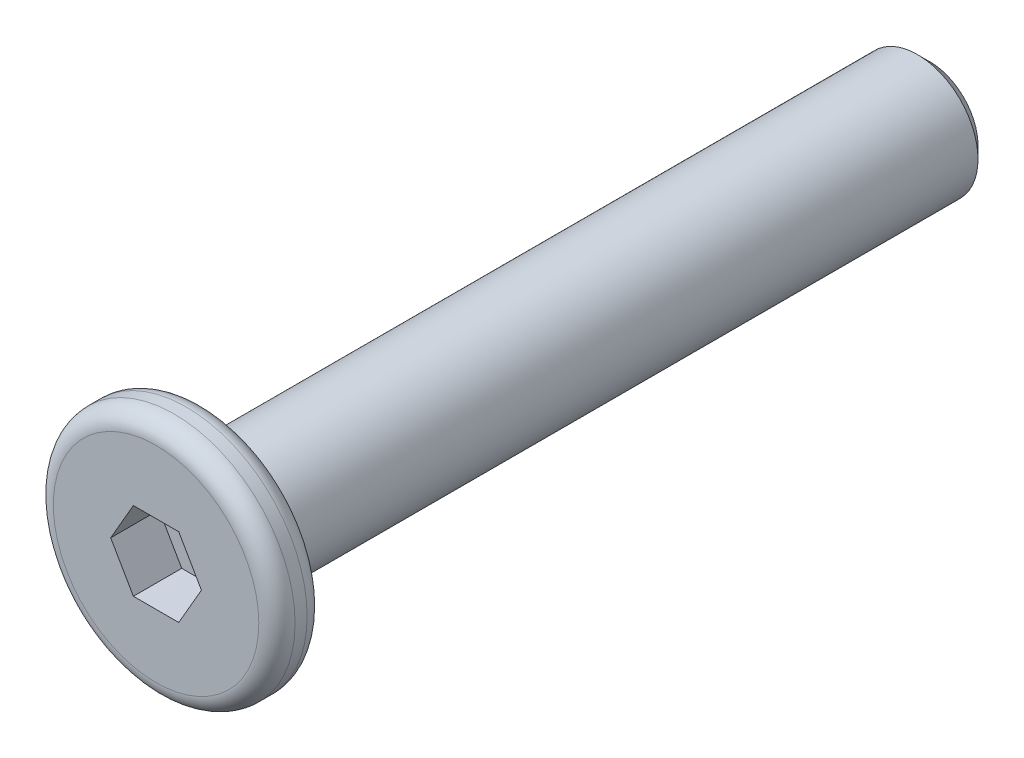
ISO-10303-21;
HEADER;
FILE_DESCRIPTION(('STEP AP214'),'2;1');
FILE_NAME('part.step','',(''),(''),'','','');
FILE_SCHEMA(('AUTOMOTIVE_DESIGN { 1 0 10303 214 1 1 1 1 }'));
ENDSEC;
DATA;
#1=APPLICATION_CONTEXT('core data for automotive mechanical design processes');
#2=APPLICATION_PROTOCOL_DEFINITION('international standard','automotive_design',2000,#1);
#3=PRODUCT_CONTEXT('',#1,'mechanical');
#4=PRODUCT('Part','Part','',(#3));
#5=PRODUCT_RELATED_PRODUCT_CATEGORY('part','',(#4));
#6=PRODUCT_DEFINITION_FORMATION('','',#4);
#7=PRODUCT_DEFINITION_CONTEXT('part definition',#1,'design');
#8=PRODUCT_DEFINITION('design','',#6,#7);
#9=PRODUCT_DEFINITION_SHAPE('','',#8);
#10=(LENGTH_UNIT() NAMED_UNIT(*) SI_UNIT(.MILLI.,.METRE.));
#11=(NAMED_UNIT(*) PLANE_ANGLE_UNIT() SI_UNIT($,.RADIAN.));
#12=(NAMED_UNIT(*) SI_UNIT($,.STERADIAN.) SOLID_ANGLE_UNIT());
#13=UNCERTAINTY_MEASURE_WITH_UNIT(LENGTH_MEASURE(1.E-05),#10,'distance_accuracy_value','');
#14=(GEOMETRIC_REPRESENTATION_CONTEXT(3) GLOBAL_UNCERTAINTY_ASSIGNED_CONTEXT((#13)) GLOBAL_UNIT_ASSIGNED_CONTEXT((#10,
#11,#12)) REPRESENTATION_CONTEXT('',''));
#15=CARTESIAN_POINT('',(0.,0.,0.));
#16=DIRECTION('',(0.,0.,1.));
#17=DIRECTION('',(1.,0.,0.));
#18=AXIS2_PLACEMENT_3D('',#15,#16,#17);
#19=CARTESIAN_POINT('',(0.,0.,0.4));
#20=DIRECTION('',(0.,0.,-1.));
#21=DIRECTION('',(-1.,0.,0.));
#22=AXIS2_PLACEMENT_3D('',#19,#20,#21);
#23=CYLINDRICAL_SURFACE('',#22,2.);
#24=CARTESIAN_POINT('',(0.,0.,-0.1));
#25=DIRECTION('',(0.,0.,1.));
#26=DIRECTION('',(1.,0.,0.));
#27=AXIS2_PLACEMENT_3D('',#24,#25,#26);
#28=CIRCLE('',#27,2.);
#29=CARTESIAN_POINT('',(2.,0.,-0.1));
#30=VERTEX_POINT('',#29);
#31=EDGE_CURVE('E154',#30,#30,#28,.T.);
#32=ORIENTED_EDGE('',*,*,#31,.T.);
#33=EDGE_LOOP('',(#32));
#34=FACE_BOUND('',#33,.T.);
#35=CARTESIAN_POINT('',(0.,0.,0.1));
#36=DIRECTION('',(0.,0.,1.));
#37=DIRECTION('',(1.,0.,0.));
#38=AXIS2_PLACEMENT_3D('',#35,#36,#37);
#39=CIRCLE('',#38,2.);
#40=CARTESIAN_POINT('',(2.,0.,0.1));
#41=VERTEX_POINT('',#40);
#42=EDGE_CURVE('E151',#41,#41,#39,.F.);
#43=ORIENTED_EDGE('',*,*,#42,.T.);
#44=EDGE_LOOP('',(#43));
#45=FACE_BOUND('',#44,.T.);
#46=ADVANCED_FACE('F35',(#34,#45),#23,.T.);
#47=CARTESIAN_POINT('',(0.,0.,0.4));
#48=DIRECTION('',(0.,0.,1.));
#49=DIRECTION('',(1.,0.,0.));
#50=AXIS2_PLACEMENT_3D('',#47,#48,#49);
#51=PLANE('',#50);
#52=CARTESIAN_POINT('',(0.,0.,0.4));
#53=DIRECTION('',(0.,0.,1.));
#54=DIRECTION('',(1.,0.,0.));
#55=AXIS2_PLACEMENT_3D('',#52,#53,#54);
#56=CIRCLE('',#55,1.7);
#57=CARTESIAN_POINT('',(1.7,0.,0.4));
#58=VERTEX_POINT('',#57);
#59=EDGE_CURVE('E11',#58,#58,#56,.T.);
#60=ORIENTED_EDGE('',*,*,#59,.T.);
#61=EDGE_LOOP('',(#60));
#62=FACE_BOUND('',#61,.T.);
#63=DIRECTION('',(0.5,0.866025403784439,0.));
#64=VECTOR('',#63,1.);
#65=CARTESIAN_POINT('',(0.375277674973257,-0.65,0.4));
#66=LINE('',#65,#64);
#67=CARTESIAN_POINT('',(0.375277674973257,-0.65,0.4));
#68=VERTEX_POINT('',#67);
#69=CARTESIAN_POINT('',(0.750555349946514,0.,0.4));
#70=VERTEX_POINT('',#69);
#71=EDGE_CURVE('E50',#68,#70,#66,.T.);
#72=ORIENTED_EDGE('',*,*,#71,.F.);
#73=DIRECTION('',(1.,0.,0.));
#74=VECTOR('',#73,1.);
#75=CARTESIAN_POINT('',(-0.375277674973256,-0.65,0.4));
#76=LINE('',#75,#74);
#77=CARTESIAN_POINT('',(-0.375277674973256,-0.65,0.4));
#78=VERTEX_POINT('',#77);
#79=EDGE_CURVE('E133',#78,#68,#76,.T.);
#80=ORIENTED_EDGE('',*,*,#79,.F.);
#81=DIRECTION('',(0.5,-0.866025403784438,0.));
#82=VECTOR('',#81,1.);
#83=CARTESIAN_POINT('',(-0.750555349946513,0.,0.4));
#84=LINE('',#83,#82);
#85=CARTESIAN_POINT('',(-0.750555349946513,0.,0.4));
#86=VERTEX_POINT('',#85);
#87=EDGE_CURVE('E131',#86,#78,#84,.T.);
#88=ORIENTED_EDGE('',*,*,#87,.F.);
#89=DIRECTION('',(-0.5,-0.866025403784439,0.));
#90=VECTOR('',#89,1.);
#91=CARTESIAN_POINT('',(-0.375277674973257,0.65,0.4));
#92=LINE('',#91,#90);
#93=CARTESIAN_POINT('',(-0.375277674973257,0.65,0.4));
#94=VERTEX_POINT('',#93);
#95=EDGE_CURVE('E98',#94,#86,#92,.T.);
#96=ORIENTED_EDGE('',*,*,#95,.F.);
#97=DIRECTION('',(-1.,0.,0.));
#98=VECTOR('',#97,1.);
#99=CARTESIAN_POINT('',(0.375277674973257,0.65,0.4));
#100=LINE('',#99,#98);
#101=CARTESIAN_POINT('',(0.375277674973257,0.65,0.4));
#102=VERTEX_POINT('',#101);
#103=EDGE_CURVE('E127',#102,#94,#100,.T.);
#104=ORIENTED_EDGE('',*,*,#103,.F.);
#105=DIRECTION('',(-0.5,0.866025403784439,0.));
#106=VECTOR('',#105,1.);
#107=CARTESIAN_POINT('',(0.750555349946514,0.,0.4));
#108=LINE('',#107,#106);
#109=EDGE_CURVE('E124',#70,#102,#108,.T.);
#110=ORIENTED_EDGE('',*,*,#109,.F.);
#111=EDGE_LOOP('',(#72,#80,#88,#96,#104,#110));
#112=FACE_BOUND('',#111,.T.);
#113=ADVANCED_FACE('F169',(#62,#112),#51,.T.);
#114=CARTESIAN_POINT('',(0.,0.,-0.4));
#115=DIRECTION('',(0.,0.,1.));
#116=DIRECTION('',(1.,0.,0.));
#117=AXIS2_PLACEMENT_3D('',#114,#115,#116);
#118=PLANE('',#117);
#119=CARTESIAN_POINT('',(0.,0.,-0.4));
#120=DIRECTION('',(0.,0.,1.));
#121=DIRECTION('',(1.,0.,0.));
#122=AXIS2_PLACEMENT_3D('',#119,#120,#121);
#123=CIRCLE('',#122,1.7);
#124=CARTESIAN_POINT('',(1.7,0.,-0.4));
#125=VERTEX_POINT('',#124);
#126=EDGE_CURVE('E43',#125,#125,#123,.F.);
#127=ORIENTED_EDGE('',*,*,#126,.T.);
#128=EDGE_LOOP('',(#127));
#129=FACE_BOUND('',#128,.T.);
#130=CARTESIAN_POINT('',(0.,0.,-0.4));
#131=DIRECTION('',(0.,0.,-1.));
#132=DIRECTION('',(-1.,0.,0.));
#133=AXIS2_PLACEMENT_3D('',#130,#131,#132);
#134=CIRCLE('',#133,1.);
#135=CARTESIAN_POINT('',(-1.,0.,-0.4));
#136=VERTEX_POINT('',#135);
#137=EDGE_CURVE('E137',#136,#136,#134,.T.);
#138=ORIENTED_EDGE('',*,*,#137,.F.);
#139=EDGE_LOOP('',(#138));
#140=FACE_BOUND('',#139,.T.);
#141=ADVANCED_FACE('F159',(#129,#140),#118,.F.);
#142=CARTESIAN_POINT('',(0.,0.,-12.4));
#143=DIRECTION('',(0.,0.,1.));
#144=DIRECTION('',(1.,0.,0.));
#145=AXIS2_PLACEMENT_3D('',#142,#143,#144);
#146=CYLINDRICAL_SURFACE('',#145,1.);
#147=CARTESIAN_POINT('',(0.,0.,-12.2));
#148=DIRECTION('',(0.,0.,-1.));
#149=DIRECTION('',(-1.,0.,0.));
#150=AXIS2_PLACEMENT_3D('',#147,#148,#149);
#151=CIRCLE('',#150,1.);
#152=CARTESIAN_POINT('',(-1.,0.,-12.2));
#153=VERTEX_POINT('',#152);
#154=EDGE_CURVE('E148',#153,#153,#151,.F.);
#155=ORIENTED_EDGE('',*,*,#154,.T.);
#156=EDGE_LOOP('',(#155));
#157=FACE_BOUND('',#156,.T.);
#158=ORIENTED_EDGE('',*,*,#137,.T.);
#159=EDGE_LOOP('',(#158));
#160=FACE_BOUND('',#159,.T.);
#161=ADVANCED_FACE('F204',(#157,#160),#146,.T.);
#162=CARTESIAN_POINT('',(0.,0.,-12.4));
#163=DIRECTION('',(0.,0.,-1.));
#164=DIRECTION('',(-1.,0.,0.));
#165=AXIS2_PLACEMENT_3D('',#162,#163,#164);
#166=PLANE('',#165);
#167=CARTESIAN_POINT('',(0.,0.,-12.4));
#168=DIRECTION('',(0.,0.,-1.));
#169=DIRECTION('',(-1.,0.,0.));
#170=AXIS2_PLACEMENT_3D('',#167,#168,#169);
#171=CIRCLE('',#170,0.799999999999999);
#172=CARTESIAN_POINT('',(-0.799999999999999,0.,-12.4));
#173=VERTEX_POINT('',#172);
#174=EDGE_CURVE('E145',#173,#173,#171,.T.);
#175=ORIENTED_EDGE('',*,*,#174,.T.);
#176=EDGE_LOOP('',(#175));
#177=FACE_BOUND('',#176,.T.);
#178=ADVANCED_FACE('F196',(#177),#166,.T.);
#179=CARTESIAN_POINT('',(0.,0.,-12.4));
#180=DIRECTION('',(0.,0.,1.));
#181=DIRECTION('',(1.,0.,0.));
#182=AXIS2_PLACEMENT_3D('',#179,#180,#181);
#183=CONICAL_SURFACE('',#182,0.799999999999999,0.78539816339745);
#184=ORIENTED_EDGE('',*,*,#154,.F.);
#185=EDGE_LOOP('',(#184));
#186=FACE_BOUND('',#185,.T.);
#187=ORIENTED_EDGE('',*,*,#174,.F.);
#188=EDGE_LOOP('',(#187));
#189=FACE_BOUND('',#188,.T.);
#190=ADVANCED_FACE('F189',(#186,#189),#183,.T.);
#191=CARTESIAN_POINT('',(0.375277674973257,-0.65,-0.4));
#192=DIRECTION('',(0.866025403784439,-0.5,0.));
#193=DIRECTION('',(0.5,0.866025403784439,0.));
#194=AXIS2_PLACEMENT_3D('',#191,#192,#193);
#195=PLANE('',#194);
#196=ORIENTED_EDGE('',*,*,#71,.T.);
#197=DIRECTION('',(0.,0.,1.));
#198=VECTOR('',#197,1.);
#199=CARTESIAN_POINT('',(0.750555349946514,0.,-0.4));
#200=LINE('',#199,#198);
#201=CARTESIAN_POINT('',(0.750555349946514,0.,-0.4));
#202=VERTEX_POINT('',#201);
#203=EDGE_CURVE('E80',#202,#70,#200,.T.);
#204=ORIENTED_EDGE('',*,*,#203,.F.);
#205=DIRECTION('',(0.5,0.866025403784439,0.));
#206=VECTOR('',#205,1.);
#207=CARTESIAN_POINT('',(0.375277674973257,-0.65,-0.4));
#208=LINE('',#207,#206);
#209=CARTESIAN_POINT('',(0.375277674973257,-0.65,-0.4));
#210=VERTEX_POINT('',#209);
#211=EDGE_CURVE('E135',#210,#202,#208,.T.);
#212=ORIENTED_EDGE('',*,*,#211,.F.);
#213=DIRECTION('',(0.,0.,1.));
#214=VECTOR('',#213,1.);
#215=CARTESIAN_POINT('',(0.375277674973257,-0.65,-0.4));
#216=LINE('',#215,#214);
#217=EDGE_CURVE('E58',#210,#68,#216,.T.);
#218=ORIENTED_EDGE('',*,*,#217,.T.);
#219=EDGE_LOOP('',(#196,#204,#212,#218));
#220=FACE_BOUND('',#219,.T.);
#221=ADVANCED_FACE('F186',(#220),#195,.F.);
#222=CARTESIAN_POINT('',(-0.375277674973256,-0.65,-0.4));
#223=DIRECTION('',(0.,-1.,0.));
#224=DIRECTION('',(1.,0.,0.));
#225=AXIS2_PLACEMENT_3D('',#222,#223,#224);
#226=PLANE('',#225);
#227=ORIENTED_EDGE('',*,*,#79,.T.);
#228=ORIENTED_EDGE('',*,*,#217,.F.);
#229=DIRECTION('',(1.,0.,0.));
#230=VECTOR('',#229,1.);
#231=CARTESIAN_POINT('',(-0.375277674973256,-0.65,-0.4));
#232=LINE('',#231,#230);
#233=CARTESIAN_POINT('',(-0.375277674973256,-0.65,-0.4));
#234=VERTEX_POINT('',#233);
#235=EDGE_CURVE('E110',#234,#210,#232,.T.);
#236=ORIENTED_EDGE('',*,*,#235,.F.);
#237=DIRECTION('',(0.,0.,1.));
#238=VECTOR('',#237,1.);
#239=CARTESIAN_POINT('',(-0.375277674973256,-0.65,-0.4));
#240=LINE('',#239,#238);
#241=EDGE_CURVE('E102',#234,#78,#240,.T.);
#242=ORIENTED_EDGE('',*,*,#241,.T.);
#243=EDGE_LOOP('',(#227,#228,#236,#242));
#244=FACE_BOUND('',#243,.T.);
#245=ADVANCED_FACE('F188',(#244),#226,.F.);
#246=CARTESIAN_POINT('',(-0.750555349946513,0.,-0.4));
#247=DIRECTION('',(-0.866025403784438,-0.5,0.));
#248=DIRECTION('',(0.5,-0.866025403784439,0.));
#249=AXIS2_PLACEMENT_3D('',#246,#247,#248);
#250=PLANE('',#249);
#251=ORIENTED_EDGE('',*,*,#87,.T.);
#252=ORIENTED_EDGE('',*,*,#241,.F.);
#253=DIRECTION('',(0.5,-0.866025403784438,0.));
#254=VECTOR('',#253,1.);
#255=CARTESIAN_POINT('',(-0.750555349946513,0.,-0.4));
#256=LINE('',#255,#254);
#257=CARTESIAN_POINT('',(-0.750555349946513,0.,-0.4));
#258=VERTEX_POINT('',#257);
#259=EDGE_CURVE('E106',#258,#234,#256,.T.);
#260=ORIENTED_EDGE('',*,*,#259,.F.);
#261=DIRECTION('',(0.,0.,1.));
#262=VECTOR('',#261,1.);
#263=CARTESIAN_POINT('',(-0.750555349946513,0.,-0.4));
#264=LINE('',#263,#262);
#265=EDGE_CURVE('E91',#258,#86,#264,.T.);
#266=ORIENTED_EDGE('',*,*,#265,.T.);
#267=EDGE_LOOP('',(#251,#252,#260,#266));
#268=FACE_BOUND('',#267,.T.);
#269=ADVANCED_FACE('F107',(#268),#250,.F.);
#270=CARTESIAN_POINT('',(-0.375277674973257,0.65,-0.4));
#271=DIRECTION('',(-0.866025403784439,0.5,0.));
#272=DIRECTION('',(-0.5,-0.866025403784439,0.));
#273=AXIS2_PLACEMENT_3D('',#270,#271,#272);
#274=PLANE('',#273);
#275=ORIENTED_EDGE('',*,*,#95,.T.);
#276=ORIENTED_EDGE('',*,*,#265,.F.);
#277=DIRECTION('',(-0.5,-0.866025403784439,0.));
#278=VECTOR('',#277,1.);
#279=CARTESIAN_POINT('',(-0.375277674973257,0.65,-0.4));
#280=LINE('',#279,#278);
#281=CARTESIAN_POINT('',(-0.375277674973257,0.65,-0.4));
#282=VERTEX_POINT('',#281);
#283=EDGE_CURVE('E95',#282,#258,#280,.T.);
#284=ORIENTED_EDGE('',*,*,#283,.F.);
#285=DIRECTION('',(0.,0.,1.));
#286=VECTOR('',#285,1.);
#287=CARTESIAN_POINT('',(-0.375277674973257,0.65,-0.4));
#288=LINE('',#287,#286);
#289=EDGE_CURVE('E103',#282,#94,#288,.T.);
#290=ORIENTED_EDGE('',*,*,#289,.T.);
#291=EDGE_LOOP('',(#275,#276,#284,#290));
#292=FACE_BOUND('',#291,.T.);
#293=ADVANCED_FACE('F93',(#292),#274,.F.);
#294=CARTESIAN_POINT('',(0.375277674973257,0.65,-0.4));
#295=DIRECTION('',(0.,1.,0.));
#296=DIRECTION('',(0.,0.,1.));
#297=AXIS2_PLACEMENT_3D('',#294,#295,#296);
#298=PLANE('',#297);
#299=ORIENTED_EDGE('',*,*,#103,.T.);
#300=ORIENTED_EDGE('',*,*,#289,.F.);
#301=DIRECTION('',(-1.,0.,0.));
#302=VECTOR('',#301,1.);
#303=CARTESIAN_POINT('',(0.375277674973257,0.65,-0.4));
#304=LINE('',#303,#302);
#305=CARTESIAN_POINT('',(0.375277674973257,0.65,-0.4));
#306=VERTEX_POINT('',#305);
#307=EDGE_CURVE('E116',#306,#282,#304,.T.);
#308=ORIENTED_EDGE('',*,*,#307,.F.);
#309=DIRECTION('',(0.,0.,1.));
#310=VECTOR('',#309,1.);
#311=CARTESIAN_POINT('',(0.375277674973257,0.65,-0.4));
#312=LINE('',#311,#310);
#313=EDGE_CURVE('E140',#306,#102,#312,.T.);
#314=ORIENTED_EDGE('',*,*,#313,.T.);
#315=EDGE_LOOP('',(#299,#300,#308,#314));
#316=FACE_BOUND('',#315,.T.);
#317=ADVANCED_FACE('F257',(#316),#298,.F.);
#318=CARTESIAN_POINT('',(0.750555349946514,0.,-0.4));
#319=DIRECTION('',(0.866025403784439,0.5,0.));
#320=DIRECTION('',(-0.5,0.866025403784439,0.));
#321=AXIS2_PLACEMENT_3D('',#318,#319,#320);
#322=PLANE('',#321);
#323=ORIENTED_EDGE('',*,*,#109,.T.);
#324=ORIENTED_EDGE('',*,*,#313,.F.);
#325=DIRECTION('',(-0.5,0.866025403784439,0.));
#326=VECTOR('',#325,1.);
#327=CARTESIAN_POINT('',(0.750555349946514,0.,-0.4));
#328=LINE('',#327,#326);
#329=EDGE_CURVE('E118',#202,#306,#328,.T.);
#330=ORIENTED_EDGE('',*,*,#329,.F.);
#331=ORIENTED_EDGE('',*,*,#203,.T.);
#332=EDGE_LOOP('',(#323,#324,#330,#331));
#333=FACE_BOUND('',#332,.T.);
#334=ADVANCED_FACE('F184',(#333),#322,.F.);
#335=CARTESIAN_POINT('',(0.,0.,-0.4));
#336=DIRECTION('',(0.,0.,1.));
#337=DIRECTION('',(1.,0.,0.));
#338=AXIS2_PLACEMENT_3D('',#335,#336,#337);
#339=PLANE('',#338);
#340=ORIENTED_EDGE('',*,*,#211,.T.);
#341=ORIENTED_EDGE('',*,*,#329,.T.);
#342=ORIENTED_EDGE('',*,*,#307,.T.);
#343=ORIENTED_EDGE('',*,*,#283,.T.);
#344=ORIENTED_EDGE('',*,*,#259,.T.);
#345=ORIENTED_EDGE('',*,*,#235,.T.);
#346=EDGE_LOOP('',(#340,#341,#342,#343,#344,#345));
#347=FACE_BOUND('',#346,.T.);
#348=ADVANCED_FACE('F113',(#347),#339,.T.);
#349=CARTESIAN_POINT('',(0.,0.,-0.1));
#350=DIRECTION('',(0.,0.,1.));
#351=DIRECTION('',(1.,0.,0.));
#352=AXIS2_PLACEMENT_3D('',#349,#350,#351);
#353=TOROIDAL_SURFACE('',#352,1.7,0.3);
#354=ORIENTED_EDGE('',*,*,#126,.F.);
#355=EDGE_LOOP('',(#354));
#356=FACE_BOUND('',#355,.T.);
#357=ORIENTED_EDGE('',*,*,#31,.F.);
#358=EDGE_LOOP('',(#357));
#359=FACE_BOUND('',#358,.T.);
#360=ADVANCED_FACE('F162',(#356,#359),#353,.T.);
#361=CARTESIAN_POINT('',(0.,0.,0.1));
#362=DIRECTION('',(0.,0.,1.));
#363=DIRECTION('',(1.,0.,0.));
#364=AXIS2_PLACEMENT_3D('',#361,#362,#363);
#365=TOROIDAL_SURFACE('',#364,1.7,0.3);
#366=ORIENTED_EDGE('',*,*,#42,.F.);
#367=EDGE_LOOP('',(#366));
#368=FACE_BOUND('',#367,.T.);
#369=ORIENTED_EDGE('',*,*,#59,.F.);
#370=EDGE_LOOP('',(#369));
#371=FACE_BOUND('',#370,.T.);
#372=ADVANCED_FACE('F37',(#368,#371),#365,.T.);
#373=CLOSED_SHELL('',(#46,#113,#141,#161,#178,#190,#221,#245,#269,#293,#317,#334,#348,#360,#372));
#374=MANIFOLD_SOLID_BREP('B2',#373);
#375=ADVANCED_BREP_SHAPE_REPRESENTATION('',(#18,#374),#14);
#376=SHAPE_DEFINITION_REPRESENTATION(#9,#375);
ENDSEC;
END-ISO-10303-21;
